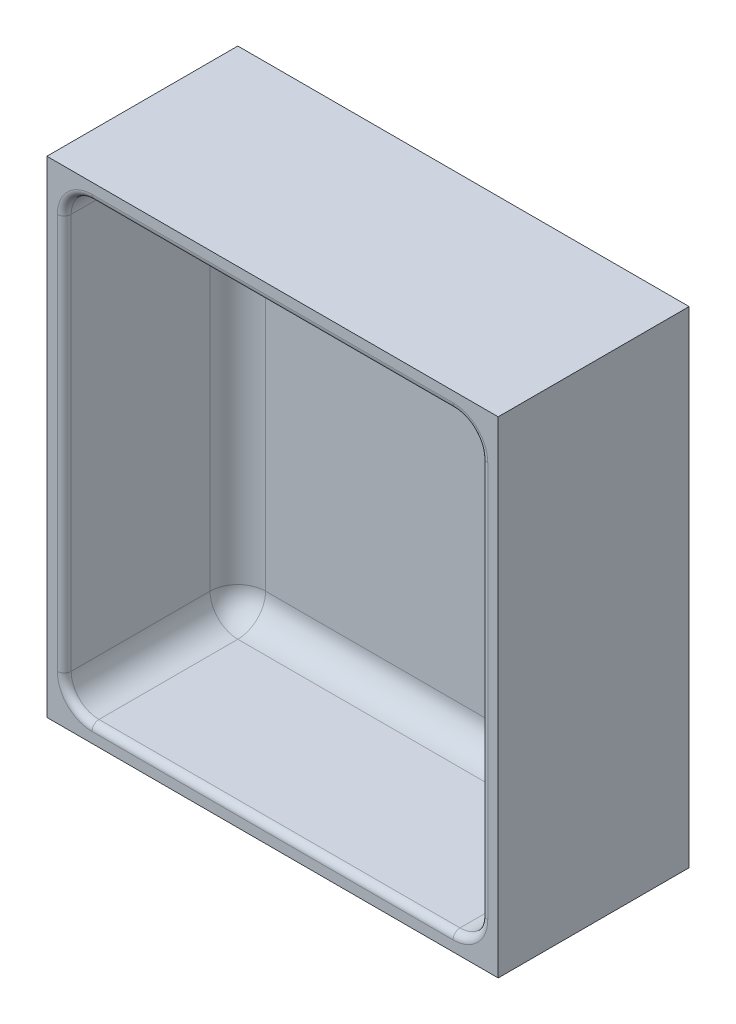
ISO-10303-21;
HEADER;
FILE_DESCRIPTION(('STEP AP214'),'2;1');
FILE_NAME('part.step','',(''),(''),'','','');
FILE_SCHEMA(('AUTOMOTIVE_DESIGN { 1 0 10303 214 1 1 1 1 }'));
ENDSEC;
DATA;
#1=APPLICATION_CONTEXT('core data for automotive mechanical design processes');
#2=APPLICATION_PROTOCOL_DEFINITION('international standard','automotive_design',2000,#1);
#3=PRODUCT_CONTEXT('',#1,'mechanical');
#4=PRODUCT('Part','Part','',(#3));
#5=PRODUCT_RELATED_PRODUCT_CATEGORY('part','',(#4));
#6=PRODUCT_DEFINITION_FORMATION('','',#4);
#7=PRODUCT_DEFINITION_CONTEXT('part definition',#1,'design');
#8=PRODUCT_DEFINITION('design','',#6,#7);
#9=PRODUCT_DEFINITION_SHAPE('','',#8);
#10=(LENGTH_UNIT() NAMED_UNIT(*) SI_UNIT(.MILLI.,.METRE.));
#11=(NAMED_UNIT(*) PLANE_ANGLE_UNIT() SI_UNIT($,.RADIAN.));
#12=(NAMED_UNIT(*) SI_UNIT($,.STERADIAN.) SOLID_ANGLE_UNIT());
#13=UNCERTAINTY_MEASURE_WITH_UNIT(LENGTH_MEASURE(1.E-05),#10,'distance_accuracy_value','');
#14=(GEOMETRIC_REPRESENTATION_CONTEXT(3) GLOBAL_UNCERTAINTY_ASSIGNED_CONTEXT((#13)) GLOBAL_UNIT_ASSIGNED_CONTEXT((#10,
#11,#12)) REPRESENTATION_CONTEXT('',''));
#15=CARTESIAN_POINT('',(0.,0.,0.));
#16=DIRECTION('',(0.,0.,1.));
#17=DIRECTION('',(1.,0.,0.));
#18=AXIS2_PLACEMENT_3D('',#15,#16,#17);
#19=CARTESIAN_POINT('',(0.,0.,5.));
#20=DIRECTION('',(0.,0.,-1.));
#21=DIRECTION('',(-1.,0.,0.));
#22=AXIS2_PLACEMENT_3D('',#19,#20,#21);
#23=PLANE('',#22);
#24=DIRECTION('',(-1.,0.,0.));
#25=VECTOR('',#24,1.);
#26=CARTESIAN_POINT('',(0.,13.,5.));
#27=LINE('',#26,#25);
#28=CARTESIAN_POINT('',(-117.,13.,5.));
#29=VERTEX_POINT('',#28);
#30=CARTESIAN_POINT('',(-13.,13.,5.));
#31=VERTEX_POINT('',#30);
#32=EDGE_CURVE('E221',#29,#31,#27,.F.);
#33=ORIENTED_EDGE('',*,*,#32,.T.);
#34=DIRECTION('',(0.,1.,0.));
#35=VECTOR('',#34,1.);
#36=CARTESIAN_POINT('',(-13.,0.,5.));
#37=LINE('',#36,#35);
#38=CARTESIAN_POINT('',(-13.,127.,5.));
#39=VERTEX_POINT('',#38);
#40=EDGE_CURVE('E227',#31,#39,#37,.T.);
#41=ORIENTED_EDGE('',*,*,#40,.T.);
#42=DIRECTION('',(1.,0.,0.));
#43=VECTOR('',#42,1.);
#44=CARTESIAN_POINT('',(0.,127.,5.));
#45=LINE('',#44,#43);
#46=CARTESIAN_POINT('',(-117.,127.,5.));
#47=VERTEX_POINT('',#46);
#48=EDGE_CURVE('E225',#39,#47,#45,.F.);
#49=ORIENTED_EDGE('',*,*,#48,.T.);
#50=DIRECTION('',(0.,1.,0.));
#51=VECTOR('',#50,1.);
#52=CARTESIAN_POINT('',(-117.,0.,5.));
#53=LINE('',#52,#51);
#54=EDGE_CURVE('E223',#47,#29,#53,.F.);
#55=ORIENTED_EDGE('',*,*,#54,.T.);
#56=EDGE_LOOP('',(#33,#41,#49,#55));
#57=FACE_BOUND('',#56,.T.);
#58=ADVANCED_FACE('F39',(#57),#23,.F.);
#59=CARTESIAN_POINT('',(-5.,5.,55.));
#60=DIRECTION('',(-1.,0.,0.));
#61=DIRECTION('',(0.,0.,1.));
#62=AXIS2_PLACEMENT_3D('',#59,#60,#61);
#63=PLANE('',#62);
#64=DIRECTION('',(0.,0.,-1.));
#65=VECTOR('',#64,1.);
#66=CARTESIAN_POINT('',(-5.,13.,55.));
#67=LINE('',#66,#65);
#68=CARTESIAN_POINT('',(-5.,13.,13.));
#69=VERTEX_POINT('',#68);
#70=CARTESIAN_POINT('',(-5.,13.,53.));
#71=VERTEX_POINT('',#70);
#72=EDGE_CURVE('E192',#69,#71,#67,.F.);
#73=ORIENTED_EDGE('',*,*,#72,.T.);
#74=DIRECTION('',(0.,1.,0.));
#75=VECTOR('',#74,1.);
#76=CARTESIAN_POINT('',(-5.,127.,53.));
#77=LINE('',#76,#75);
#78=CARTESIAN_POINT('',(-5.,127.,53.));
#79=VERTEX_POINT('',#78);
#80=EDGE_CURVE('E293',#71,#79,#77,.T.);
#81=ORIENTED_EDGE('',*,*,#80,.T.);
#82=DIRECTION('',(0.,0.,-1.));
#83=VECTOR('',#82,1.);
#84=CARTESIAN_POINT('',(-5.,127.,5.));
#85=LINE('',#84,#83);
#86=CARTESIAN_POINT('',(-5.,127.,13.));
#87=VERTEX_POINT('',#86);
#88=EDGE_CURVE('E199',#79,#87,#85,.T.);
#89=ORIENTED_EDGE('',*,*,#88,.T.);
#90=DIRECTION('',(0.,1.,0.));
#91=VECTOR('',#90,1.);
#92=CARTESIAN_POINT('',(-5.,5.,13.));
#93=LINE('',#92,#91);
#94=EDGE_CURVE('E190',#87,#69,#93,.F.);
#95=ORIENTED_EDGE('',*,*,#94,.T.);
#96=EDGE_LOOP('',(#73,#81,#89,#95));
#97=FACE_BOUND('',#96,.T.);
#98=ADVANCED_FACE('F350',(#97),#63,.T.);
#99=CARTESIAN_POINT('',(-125.,135.,55.));
#100=DIRECTION('',(0.,-1.,0.));
#101=DIRECTION('',(0.,0.,-1.));
#102=AXIS2_PLACEMENT_3D('',#99,#100,#101);
#103=PLANE('',#102);
#104=DIRECTION('',(0.,0.,-1.));
#105=VECTOR('',#104,1.);
#106=CARTESIAN_POINT('',(-13.,135.,55.));
#107=LINE('',#106,#105);
#108=CARTESIAN_POINT('',(-13.,135.,13.));
#109=VERTEX_POINT('',#108);
#110=CARTESIAN_POINT('',(-13.,135.,53.));
#111=VERTEX_POINT('',#110);
#112=EDGE_CURVE('E205',#109,#111,#107,.F.);
#113=ORIENTED_EDGE('',*,*,#112,.T.);
#114=DIRECTION('',(-1.,0.,0.));
#115=VECTOR('',#114,1.);
#116=CARTESIAN_POINT('',(-117.,135.,53.));
#117=LINE('',#116,#115);
#118=CARTESIAN_POINT('',(-117.,135.,53.));
#119=VERTEX_POINT('',#118);
#120=EDGE_CURVE('E289',#111,#119,#117,.T.);
#121=ORIENTED_EDGE('',*,*,#120,.T.);
#122=DIRECTION('',(0.,0.,-1.));
#123=VECTOR('',#122,1.);
#124=CARTESIAN_POINT('',(-117.,135.,5.));
#125=LINE('',#124,#123);
#126=CARTESIAN_POINT('',(-117.,135.,13.));
#127=VERTEX_POINT('',#126);
#128=EDGE_CURVE('E203',#119,#127,#125,.T.);
#129=ORIENTED_EDGE('',*,*,#128,.T.);
#130=DIRECTION('',(1.,0.,0.));
#131=VECTOR('',#130,1.);
#132=CARTESIAN_POINT('',(-125.,135.,13.));
#133=LINE('',#132,#131);
#134=EDGE_CURVE('E201',#127,#109,#133,.T.);
#135=ORIENTED_EDGE('',*,*,#134,.T.);
#136=EDGE_LOOP('',(#113,#121,#129,#135));
#137=FACE_BOUND('',#136,.T.);
#138=ADVANCED_FACE('F333',(#137),#103,.T.);
#139=CARTESIAN_POINT('',(-125.,5.,55.));
#140=DIRECTION('',(1.,0.,0.));
#141=DIRECTION('',(0.,0.,-1.));
#142=AXIS2_PLACEMENT_3D('',#139,#140,#141);
#143=PLANE('',#142);
#144=DIRECTION('',(0.,0.,-1.));
#145=VECTOR('',#144,1.);
#146=CARTESIAN_POINT('',(-125.,127.,55.));
#147=LINE('',#146,#145);
#148=CARTESIAN_POINT('',(-125.,127.,13.));
#149=VERTEX_POINT('',#148);
#150=CARTESIAN_POINT('',(-125.,127.,53.));
#151=VERTEX_POINT('',#150);
#152=EDGE_CURVE('E212',#149,#151,#147,.F.);
#153=ORIENTED_EDGE('',*,*,#152,.T.);
#154=DIRECTION('',(0.,-1.,0.));
#155=VECTOR('',#154,1.);
#156=CARTESIAN_POINT('',(-125.,13.,53.));
#157=LINE('',#156,#155);
#158=CARTESIAN_POINT('',(-125.,13.,53.));
#159=VERTEX_POINT('',#158);
#160=EDGE_CURVE('E285',#151,#159,#157,.T.);
#161=ORIENTED_EDGE('',*,*,#160,.T.);
#162=DIRECTION('',(0.,0.,-1.));
#163=VECTOR('',#162,1.);
#164=CARTESIAN_POINT('',(-125.,13.,5.));
#165=LINE('',#164,#163);
#166=CARTESIAN_POINT('',(-125.,13.,13.));
#167=VERTEX_POINT('',#166);
#168=EDGE_CURVE('E210',#159,#167,#165,.T.);
#169=ORIENTED_EDGE('',*,*,#168,.T.);
#170=DIRECTION('',(0.,1.,0.));
#171=VECTOR('',#170,1.);
#172=CARTESIAN_POINT('',(-125.,5.,13.));
#173=LINE('',#172,#171);
#174=EDGE_CURVE('E208',#167,#149,#173,.T.);
#175=ORIENTED_EDGE('',*,*,#174,.T.);
#176=EDGE_LOOP('',(#153,#161,#169,#175));
#177=FACE_BOUND('',#176,.T.);
#178=ADVANCED_FACE('F378',(#177),#143,.T.);
#179=CARTESIAN_POINT('',(-5.,5.,55.));
#180=DIRECTION('',(0.,1.,0.));
#181=DIRECTION('',(0.,0.,1.));
#182=AXIS2_PLACEMENT_3D('',#179,#180,#181);
#183=PLANE('',#182);
#184=DIRECTION('',(0.,0.,-1.));
#185=VECTOR('',#184,1.);
#186=CARTESIAN_POINT('',(-117.,5.,55.));
#187=LINE('',#186,#185);
#188=CARTESIAN_POINT('',(-117.,5.,13.));
#189=VERTEX_POINT('',#188);
#190=CARTESIAN_POINT('',(-117.,5.,53.));
#191=VERTEX_POINT('',#190);
#192=EDGE_CURVE('E219',#189,#191,#187,.F.);
#193=ORIENTED_EDGE('',*,*,#192,.T.);
#194=DIRECTION('',(1.,0.,0.));
#195=VECTOR('',#194,1.);
#196=CARTESIAN_POINT('',(-13.,5.,53.));
#197=LINE('',#196,#195);
#198=CARTESIAN_POINT('',(-13.,5.,53.));
#199=VERTEX_POINT('',#198);
#200=EDGE_CURVE('E11',#191,#199,#197,.T.);
#201=ORIENTED_EDGE('',*,*,#200,.T.);
#202=DIRECTION('',(0.,0.,-1.));
#203=VECTOR('',#202,1.);
#204=CARTESIAN_POINT('',(-13.,5.,5.));
#205=LINE('',#204,#203);
#206=CARTESIAN_POINT('',(-13.,5.,13.));
#207=VERTEX_POINT('',#206);
#208=EDGE_CURVE('E217',#199,#207,#205,.T.);
#209=ORIENTED_EDGE('',*,*,#208,.T.);
#210=DIRECTION('',(-1.,0.,0.));
#211=VECTOR('',#210,1.);
#212=CARTESIAN_POINT('',(-5.,5.,13.));
#213=LINE('',#212,#211);
#214=EDGE_CURVE('E215',#207,#189,#213,.T.);
#215=ORIENTED_EDGE('',*,*,#214,.T.);
#216=EDGE_LOOP('',(#193,#201,#209,#215));
#217=FACE_BOUND('',#216,.T.);
#218=ADVANCED_FACE('F362',(#217),#183,.T.);
#219=CARTESIAN_POINT('',(0.,0.,55.));
#220=DIRECTION('',(0.,0.,-1.));
#221=DIRECTION('',(-1.,0.,0.));
#222=AXIS2_PLACEMENT_3D('',#219,#220,#221);
#223=PLANE('',#222);
#224=DIRECTION('',(1.,0.,0.));
#225=VECTOR('',#224,1.);
#226=CARTESIAN_POINT('',(-117.,3.,55.));
#227=LINE('',#226,#225);
#228=CARTESIAN_POINT('',(-13.,3.,55.));
#229=VERTEX_POINT('',#228);
#230=CARTESIAN_POINT('',(-117.,3.,55.));
#231=VERTEX_POINT('',#230);
#232=EDGE_CURVE('E230',#229,#231,#227,.F.);
#233=ORIENTED_EDGE('',*,*,#232,.T.);
#234=CARTESIAN_POINT('',(-117.,13.,55.));
#235=DIRECTION('',(0.,0.,-1.));
#236=DIRECTION('',(-1.,0.,0.));
#237=AXIS2_PLACEMENT_3D('',#234,#235,#236);
#238=CIRCLE('',#237,10.);
#239=CARTESIAN_POINT('',(-127.,13.,55.));
#240=VERTEX_POINT('',#239);
#241=EDGE_CURVE('E279',#231,#240,#238,.T.);
#242=ORIENTED_EDGE('',*,*,#241,.T.);
#243=DIRECTION('',(0.,-1.,0.));
#244=VECTOR('',#243,1.);
#245=CARTESIAN_POINT('',(-127.,127.,55.));
#246=LINE('',#245,#244);
#247=CARTESIAN_POINT('',(-127.,127.,55.));
#248=VERTEX_POINT('',#247);
#249=EDGE_CURVE('E277',#240,#248,#246,.F.);
#250=ORIENTED_EDGE('',*,*,#249,.T.);
#251=CARTESIAN_POINT('',(-117.,127.,55.));
#252=DIRECTION('',(0.,0.,-1.));
#253=DIRECTION('',(-1.,0.,0.));
#254=AXIS2_PLACEMENT_3D('',#251,#252,#253);
#255=CIRCLE('',#254,10.);
#256=CARTESIAN_POINT('',(-117.,137.,55.));
#257=VERTEX_POINT('',#256);
#258=EDGE_CURVE('E275',#248,#257,#255,.T.);
#259=ORIENTED_EDGE('',*,*,#258,.T.);
#260=DIRECTION('',(-1.,0.,0.));
#261=VECTOR('',#260,1.);
#262=CARTESIAN_POINT('',(-13.,137.,55.));
#263=LINE('',#262,#261);
#264=CARTESIAN_POINT('',(-13.,137.,55.));
#265=VERTEX_POINT('',#264);
#266=EDGE_CURVE('E273',#257,#265,#263,.F.);
#267=ORIENTED_EDGE('',*,*,#266,.T.);
#268=CARTESIAN_POINT('',(-13.,127.,55.));
#269=DIRECTION('',(0.,0.,-1.));
#270=DIRECTION('',(-1.,0.,0.));
#271=AXIS2_PLACEMENT_3D('',#268,#269,#270);
#272=CIRCLE('',#271,10.);
#273=CARTESIAN_POINT('',(-3.,127.,55.));
#274=VERTEX_POINT('',#273);
#275=EDGE_CURVE('E271',#265,#274,#272,.T.);
#276=ORIENTED_EDGE('',*,*,#275,.T.);
#277=DIRECTION('',(0.,1.,0.));
#278=VECTOR('',#277,1.);
#279=CARTESIAN_POINT('',(-3.,13.,55.));
#280=LINE('',#279,#278);
#281=CARTESIAN_POINT('',(-3.,13.,55.));
#282=VERTEX_POINT('',#281);
#283=EDGE_CURVE('E269',#274,#282,#280,.F.);
#284=ORIENTED_EDGE('',*,*,#283,.T.);
#285=CARTESIAN_POINT('',(-13.,13.,55.));
#286=DIRECTION('',(0.,0.,-1.));
#287=DIRECTION('',(-1.,0.,0.));
#288=AXIS2_PLACEMENT_3D('',#285,#286,#287);
#289=CIRCLE('',#288,10.);
#290=EDGE_CURVE('E267',#282,#229,#289,.T.);
#291=ORIENTED_EDGE('',*,*,#290,.T.);
#292=EDGE_LOOP('',(#233,#242,#250,#259,#267,#276,#284,#291));
#293=FACE_BOUND('',#292,.T.);
#294=DIRECTION('',(1.,0.,0.));
#295=VECTOR('',#294,1.);
#296=CARTESIAN_POINT('',(0.,0.,55.));
#297=LINE('',#296,#295);
#298=CARTESIAN_POINT('',(-130.,0.,55.));
#299=VERTEX_POINT('',#298);
#300=CARTESIAN_POINT('',(0.,0.,55.));
#301=VERTEX_POINT('',#300);
#302=EDGE_CURVE('E176',#299,#301,#297,.T.);
#303=ORIENTED_EDGE('',*,*,#302,.T.);
#304=DIRECTION('',(0.,1.,0.));
#305=VECTOR('',#304,1.);
#306=CARTESIAN_POINT('',(0.,0.,55.));
#307=LINE('',#306,#305);
#308=CARTESIAN_POINT('',(0.,140.,55.));
#309=VERTEX_POINT('',#308);
#310=EDGE_CURVE('E165',#301,#309,#307,.T.);
#311=ORIENTED_EDGE('',*,*,#310,.T.);
#312=DIRECTION('',(-1.,0.,0.));
#313=VECTOR('',#312,1.);
#314=CARTESIAN_POINT('',(-130.,140.,55.));
#315=LINE('',#314,#313);
#316=CARTESIAN_POINT('',(-130.,140.,55.));
#317=VERTEX_POINT('',#316);
#318=EDGE_CURVE('E175',#309,#317,#315,.T.);
#319=ORIENTED_EDGE('',*,*,#318,.T.);
#320=DIRECTION('',(0.,-1.,0.));
#321=VECTOR('',#320,1.);
#322=CARTESIAN_POINT('',(-130.,0.,55.));
#323=LINE('',#322,#321);
#324=EDGE_CURVE('E181',#317,#299,#323,.T.);
#325=ORIENTED_EDGE('',*,*,#324,.T.);
#326=EDGE_LOOP('',(#303,#311,#319,#325));
#327=FACE_BOUND('',#326,.T.);
#328=ADVANCED_FACE('F179',(#293,#327),#223,.F.);
#329=CARTESIAN_POINT('',(0.,0.,55.));
#330=DIRECTION('',(0.,1.,0.));
#331=DIRECTION('',(0.,0.,1.));
#332=AXIS2_PLACEMENT_3D('',#329,#330,#331);
#333=PLANE('',#332);
#334=DIRECTION('',(1.,0.,0.));
#335=VECTOR('',#334,1.);
#336=CARTESIAN_POINT('',(0.,0.,0.));
#337=LINE('',#336,#335);
#338=CARTESIAN_POINT('',(-130.,0.,0.));
#339=VERTEX_POINT('',#338);
#340=CARTESIAN_POINT('',(0.,0.,0.));
#341=VERTEX_POINT('',#340);
#342=EDGE_CURVE('E189',#339,#341,#337,.T.);
#343=ORIENTED_EDGE('',*,*,#342,.T.);
#344=DIRECTION('',(0.,0.,-1.));
#345=VECTOR('',#344,1.);
#346=CARTESIAN_POINT('',(0.,0.,55.));
#347=LINE('',#346,#345);
#348=EDGE_CURVE('E169',#301,#341,#347,.T.);
#349=ORIENTED_EDGE('',*,*,#348,.F.);
#350=ORIENTED_EDGE('',*,*,#302,.F.);
#351=DIRECTION('',(0.,0.,-1.));
#352=VECTOR('',#351,1.);
#353=CARTESIAN_POINT('',(-130.,0.,55.));
#354=LINE('',#353,#352);
#355=EDGE_CURVE('E671',#299,#339,#354,.T.);
#356=ORIENTED_EDGE('',*,*,#355,.T.);
#357=EDGE_LOOP('',(#343,#349,#350,#356));
#358=FACE_BOUND('',#357,.T.);
#359=ADVANCED_FACE('F187',(#358),#333,.F.);
#360=CARTESIAN_POINT('',(0.,0.,55.));
#361=DIRECTION('',(-1.,0.,0.));
#362=DIRECTION('',(0.,0.,1.));
#363=AXIS2_PLACEMENT_3D('',#360,#361,#362);
#364=PLANE('',#363);
#365=DIRECTION('',(0.,1.,0.));
#366=VECTOR('',#365,1.);
#367=CARTESIAN_POINT('',(0.,0.,0.));
#368=LINE('',#367,#366);
#369=CARTESIAN_POINT('',(0.,140.,0.));
#370=VERTEX_POINT('',#369);
#371=EDGE_CURVE('E669',#341,#370,#368,.T.);
#372=ORIENTED_EDGE('',*,*,#371,.T.);
#373=DIRECTION('',(0.,0.,-1.));
#374=VECTOR('',#373,1.);
#375=CARTESIAN_POINT('',(0.,140.,55.));
#376=LINE('',#375,#374);
#377=EDGE_CURVE('E172',#309,#370,#376,.T.);
#378=ORIENTED_EDGE('',*,*,#377,.F.);
#379=ORIENTED_EDGE('',*,*,#310,.F.);
#380=ORIENTED_EDGE('',*,*,#348,.T.);
#381=EDGE_LOOP('',(#372,#378,#379,#380));
#382=FACE_BOUND('',#381,.T.);
#383=ADVANCED_FACE('F167',(#382),#364,.F.);
#384=CARTESIAN_POINT('',(-130.,140.,55.));
#385=DIRECTION('',(0.,-1.,0.));
#386=DIRECTION('',(0.,0.,-1.));
#387=AXIS2_PLACEMENT_3D('',#384,#385,#386);
#388=PLANE('',#387);
#389=DIRECTION('',(-1.,0.,0.));
#390=VECTOR('',#389,1.);
#391=CARTESIAN_POINT('',(-130.,140.,0.));
#392=LINE('',#391,#390);
#393=CARTESIAN_POINT('',(-130.,140.,0.));
#394=VERTEX_POINT('',#393);
#395=EDGE_CURVE('E666',#370,#394,#392,.T.);
#396=ORIENTED_EDGE('',*,*,#395,.T.);
#397=DIRECTION('',(0.,0.,-1.));
#398=VECTOR('',#397,1.);
#399=CARTESIAN_POINT('',(-130.,140.,55.));
#400=LINE('',#399,#398);
#401=EDGE_CURVE('E194',#317,#394,#400,.T.);
#402=ORIENTED_EDGE('',*,*,#401,.F.);
#403=ORIENTED_EDGE('',*,*,#318,.F.);
#404=ORIENTED_EDGE('',*,*,#377,.T.);
#405=EDGE_LOOP('',(#396,#402,#403,#404));
#406=FACE_BOUND('',#405,.T.);
#407=ADVANCED_FACE('F572',(#406),#388,.F.);
#408=CARTESIAN_POINT('',(-130.,0.,55.));
#409=DIRECTION('',(1.,0.,0.));
#410=DIRECTION('',(0.,0.,-1.));
#411=AXIS2_PLACEMENT_3D('',#408,#409,#410);
#412=PLANE('',#411);
#413=DIRECTION('',(0.,-1.,0.));
#414=VECTOR('',#413,1.);
#415=CARTESIAN_POINT('',(-130.,0.,0.));
#416=LINE('',#415,#414);
#417=EDGE_CURVE('E185',#394,#339,#416,.T.);
#418=ORIENTED_EDGE('',*,*,#417,.T.);
#419=ORIENTED_EDGE('',*,*,#355,.F.);
#420=ORIENTED_EDGE('',*,*,#324,.F.);
#421=ORIENTED_EDGE('',*,*,#401,.T.);
#422=EDGE_LOOP('',(#418,#419,#420,#421));
#423=FACE_BOUND('',#422,.T.);
#424=ADVANCED_FACE('F427',(#423),#412,.F.);
#425=CARTESIAN_POINT('',(0.,0.,0.));
#426=DIRECTION('',(0.,0.,-1.));
#427=DIRECTION('',(-1.,0.,0.));
#428=AXIS2_PLACEMENT_3D('',#425,#426,#427);
#429=PLANE('',#428);
#430=ORIENTED_EDGE('',*,*,#342,.F.);
#431=ORIENTED_EDGE('',*,*,#417,.F.);
#432=ORIENTED_EDGE('',*,*,#395,.F.);
#433=ORIENTED_EDGE('',*,*,#371,.F.);
#434=EDGE_LOOP('',(#430,#431,#432,#433));
#435=FACE_BOUND('',#434,.T.);
#436=ADVANCED_FACE('F425',(#435),#429,.T.);
#437=CARTESIAN_POINT('',(-117.,13.,55.));
#438=DIRECTION('',(0.,0.,1.));
#439=DIRECTION('',(1.,0.,0.));
#440=AXIS2_PLACEMENT_3D('',#437,#438,#439);
#441=CYLINDRICAL_SURFACE('',#440,8.);
#442=ORIENTED_EDGE('',*,*,#168,.F.);
#443=CARTESIAN_POINT('',(-117.,13.,53.));
#444=DIRECTION('',(0.,0.,-1.));
#445=DIRECTION('',(-1.,0.,0.));
#446=AXIS2_PLACEMENT_3D('',#443,#444,#445);
#447=CIRCLE('',#446,8.);
#448=EDGE_CURVE('E282',#159,#191,#447,.F.);
#449=ORIENTED_EDGE('',*,*,#448,.T.);
#450=ORIENTED_EDGE('',*,*,#192,.F.);
#451=CARTESIAN_POINT('',(-117.,13.,13.));
#452=DIRECTION('',(0.,0.,1.));
#453=DIRECTION('',(1.,0.,0.));
#454=AXIS2_PLACEMENT_3D('',#451,#452,#453);
#455=CIRCLE('',#454,8.);
#456=EDGE_CURVE('E263',#167,#189,#455,.T.);
#457=ORIENTED_EDGE('',*,*,#456,.F.);
#458=EDGE_LOOP('',(#442,#449,#450,#457));
#459=FACE_BOUND('',#458,.T.);
#460=ADVANCED_FACE('F366',(#459),#441,.F.);
#461=CARTESIAN_POINT('',(-117.,13.,13.));
#462=DIRECTION('',(0.,-1.,0.));
#463=DIRECTION('',(0.,0.,-1.));
#464=AXIS2_PLACEMENT_3D('',#461,#462,#463);
#465=SPHERICAL_SURFACE('',#464,8.);
#466=CARTESIAN_POINT('',(-117.,13.,13.));
#467=DIRECTION('',(0.,1.,0.));
#468=DIRECTION('',(0.,0.,1.));
#469=AXIS2_PLACEMENT_3D('',#466,#467,#468);
#470=CIRCLE('',#469,8.);
#471=EDGE_CURVE('E257',#167,#29,#470,.F.);
#472=ORIENTED_EDGE('',*,*,#471,.F.);
#473=ORIENTED_EDGE('',*,*,#456,.T.);
#474=CARTESIAN_POINT('',(-117.,13.,13.));
#475=DIRECTION('',(1.,0.,0.));
#476=DIRECTION('',(0.,0.,-1.));
#477=AXIS2_PLACEMENT_3D('',#474,#475,#476);
#478=CIRCLE('',#477,8.);
#479=EDGE_CURVE('E260',#29,#189,#478,.F.);
#480=ORIENTED_EDGE('',*,*,#479,.F.);
#481=EDGE_LOOP('',(#472,#473,#480));
#482=FACE_BOUND('',#481,.T.);
#483=ADVANCED_FACE('F370',(#482),#465,.F.);
#484=CARTESIAN_POINT('',(-13.,13.,55.));
#485=DIRECTION('',(0.,0.,1.));
#486=DIRECTION('',(1.,0.,0.));
#487=AXIS2_PLACEMENT_3D('',#484,#485,#486);
#488=CYLINDRICAL_SURFACE('',#487,8.);
#489=ORIENTED_EDGE('',*,*,#208,.F.);
#490=CARTESIAN_POINT('',(-13.,13.,53.));
#491=DIRECTION('',(0.,0.,-1.));
#492=DIRECTION('',(-1.,0.,0.));
#493=AXIS2_PLACEMENT_3D('',#490,#491,#492);
#494=CIRCLE('',#493,8.);
#495=EDGE_CURVE('E48',#199,#71,#494,.F.);
#496=ORIENTED_EDGE('',*,*,#495,.T.);
#497=ORIENTED_EDGE('',*,*,#72,.F.);
#498=CARTESIAN_POINT('',(-13.,13.,13.));
#499=DIRECTION('',(0.,0.,1.));
#500=DIRECTION('',(1.,0.,0.));
#501=AXIS2_PLACEMENT_3D('',#498,#499,#500);
#502=CIRCLE('',#501,8.);
#503=EDGE_CURVE('E254',#207,#69,#502,.T.);
#504=ORIENTED_EDGE('',*,*,#503,.F.);
#505=EDGE_LOOP('',(#489,#496,#497,#504));
#506=FACE_BOUND('',#505,.T.);
#507=ADVANCED_FACE('F352',(#506),#488,.F.);
#508=CARTESIAN_POINT('',(-5.,13.,13.));
#509=DIRECTION('',(-1.,0.,0.));
#510=DIRECTION('',(0.,0.,1.));
#511=AXIS2_PLACEMENT_3D('',#508,#509,#510);
#512=CYLINDRICAL_SURFACE('',#511,8.);
#513=ORIENTED_EDGE('',*,*,#479,.T.);
#514=ORIENTED_EDGE('',*,*,#214,.F.);
#515=CARTESIAN_POINT('',(-13.,13.,13.));
#516=DIRECTION('',(-1.,0.,0.));
#517=DIRECTION('',(0.,0.,1.));
#518=AXIS2_PLACEMENT_3D('',#515,#516,#517);
#519=CIRCLE('',#518,8.);
#520=EDGE_CURVE('E251',#31,#207,#519,.T.);
#521=ORIENTED_EDGE('',*,*,#520,.F.);
#522=ORIENTED_EDGE('',*,*,#32,.F.);
#523=EDGE_LOOP('',(#513,#514,#521,#522));
#524=FACE_BOUND('',#523,.T.);
#525=ADVANCED_FACE('F359',(#524),#512,.F.);
#526=CARTESIAN_POINT('',(-117.,5.,13.));
#527=DIRECTION('',(0.,1.,0.));
#528=DIRECTION('',(0.,0.,1.));
#529=AXIS2_PLACEMENT_3D('',#526,#527,#528);
#530=CYLINDRICAL_SURFACE('',#529,8.);
#531=ORIENTED_EDGE('',*,*,#471,.T.);
#532=ORIENTED_EDGE('',*,*,#54,.F.);
#533=CARTESIAN_POINT('',(-117.,127.,13.));
#534=DIRECTION('',(0.,-1.,0.));
#535=DIRECTION('',(0.,0.,-1.));
#536=AXIS2_PLACEMENT_3D('',#533,#534,#535);
#537=CIRCLE('',#536,8.);
#538=EDGE_CURVE('E248',#149,#47,#537,.T.);
#539=ORIENTED_EDGE('',*,*,#538,.F.);
#540=ORIENTED_EDGE('',*,*,#174,.F.);
#541=EDGE_LOOP('',(#531,#532,#539,#540));
#542=FACE_BOUND('',#541,.T.);
#543=ADVANCED_FACE('F375',(#542),#530,.F.);
#544=CARTESIAN_POINT('',(-117.,127.,55.));
#545=DIRECTION('',(0.,0.,1.));
#546=DIRECTION('',(1.,0.,0.));
#547=AXIS2_PLACEMENT_3D('',#544,#545,#546);
#548=CYLINDRICAL_SURFACE('',#547,8.);
#549=ORIENTED_EDGE('',*,*,#128,.F.);
#550=CARTESIAN_POINT('',(-117.,127.,53.));
#551=DIRECTION('',(0.,0.,-1.));
#552=DIRECTION('',(-1.,0.,0.));
#553=AXIS2_PLACEMENT_3D('',#550,#551,#552);
#554=CIRCLE('',#553,8.);
#555=EDGE_CURVE('E287',#119,#151,#554,.F.);
#556=ORIENTED_EDGE('',*,*,#555,.T.);
#557=ORIENTED_EDGE('',*,*,#152,.F.);
#558=CARTESIAN_POINT('',(-117.,127.,13.));
#559=DIRECTION('',(0.,0.,1.));
#560=DIRECTION('',(1.,0.,0.));
#561=AXIS2_PLACEMENT_3D('',#558,#559,#560);
#562=CIRCLE('',#561,8.);
#563=EDGE_CURVE('E245',#127,#149,#562,.T.);
#564=ORIENTED_EDGE('',*,*,#563,.F.);
#565=EDGE_LOOP('',(#549,#556,#557,#564));
#566=FACE_BOUND('',#565,.T.);
#567=ADVANCED_FACE('F381',(#566),#548,.F.);
#568=CARTESIAN_POINT('',(-13.,13.,13.));
#569=DIRECTION('',(0.,-1.,0.));
#570=DIRECTION('',(0.,0.,-1.));
#571=AXIS2_PLACEMENT_3D('',#568,#569,#570);
#572=SPHERICAL_SURFACE('',#571,8.);
#573=ORIENTED_EDGE('',*,*,#520,.T.);
#574=ORIENTED_EDGE('',*,*,#503,.T.);
#575=CARTESIAN_POINT('',(-13.,13.,13.));
#576=DIRECTION('',(0.,1.,0.));
#577=DIRECTION('',(0.,0.,1.));
#578=AXIS2_PLACEMENT_3D('',#575,#576,#577);
#579=CIRCLE('',#578,8.);
#580=EDGE_CURVE('E242',#31,#69,#579,.F.);
#581=ORIENTED_EDGE('',*,*,#580,.F.);
#582=EDGE_LOOP('',(#573,#574,#581));
#583=FACE_BOUND('',#582,.T.);
#584=ADVANCED_FACE('F354',(#583),#572,.F.);
#585=CARTESIAN_POINT('',(-117.,127.,13.));
#586=DIRECTION('',(-1.,0.,0.));
#587=DIRECTION('',(0.,0.,1.));
#588=AXIS2_PLACEMENT_3D('',#585,#586,#587);
#589=SPHERICAL_SURFACE('',#588,8.);
#590=ORIENTED_EDGE('',*,*,#563,.T.);
#591=ORIENTED_EDGE('',*,*,#538,.T.);
#592=CARTESIAN_POINT('',(-117.,127.,13.));
#593=DIRECTION('',(1.,0.,0.));
#594=DIRECTION('',(0.,0.,-1.));
#595=AXIS2_PLACEMENT_3D('',#592,#593,#594);
#596=CIRCLE('',#595,8.);
#597=EDGE_CURVE('E239',#127,#47,#596,.F.);
#598=ORIENTED_EDGE('',*,*,#597,.F.);
#599=EDGE_LOOP('',(#590,#591,#598));
#600=FACE_BOUND('',#599,.T.);
#601=ADVANCED_FACE('F437',(#600),#589,.F.);
#602=CARTESIAN_POINT('',(-13.,0.,13.));
#603=DIRECTION('',(0.,1.,0.));
#604=DIRECTION('',(0.,0.,1.));
#605=AXIS2_PLACEMENT_3D('',#602,#603,#604);
#606=CYLINDRICAL_SURFACE('',#605,8.);
#607=ORIENTED_EDGE('',*,*,#580,.T.);
#608=ORIENTED_EDGE('',*,*,#94,.F.);
#609=CARTESIAN_POINT('',(-13.,127.,13.));
#610=DIRECTION('',(0.,-1.,0.));
#611=DIRECTION('',(0.,0.,-1.));
#612=AXIS2_PLACEMENT_3D('',#609,#610,#611);
#613=CIRCLE('',#612,8.);
#614=EDGE_CURVE('E236',#39,#87,#613,.T.);
#615=ORIENTED_EDGE('',*,*,#614,.F.);
#616=ORIENTED_EDGE('',*,*,#40,.F.);
#617=EDGE_LOOP('',(#607,#608,#615,#616));
#618=FACE_BOUND('',#617,.T.);
#619=ADVANCED_FACE('F347',(#618),#606,.F.);
#620=CARTESIAN_POINT('',(-125.,127.,13.));
#621=DIRECTION('',(1.,0.,0.));
#622=DIRECTION('',(0.,0.,-1.));
#623=AXIS2_PLACEMENT_3D('',#620,#621,#622);
#624=CYLINDRICAL_SURFACE('',#623,8.);
#625=ORIENTED_EDGE('',*,*,#597,.T.);
#626=ORIENTED_EDGE('',*,*,#48,.F.);
#627=CARTESIAN_POINT('',(-13.,127.,13.));
#628=DIRECTION('',(-1.,0.,0.));
#629=DIRECTION('',(0.,0.,1.));
#630=AXIS2_PLACEMENT_3D('',#627,#628,#629);
#631=CIRCLE('',#630,8.);
#632=EDGE_CURVE('E234',#109,#39,#631,.T.);
#633=ORIENTED_EDGE('',*,*,#632,.F.);
#634=ORIENTED_EDGE('',*,*,#134,.F.);
#635=EDGE_LOOP('',(#625,#626,#633,#634));
#636=FACE_BOUND('',#635,.T.);
#637=ADVANCED_FACE('F340',(#636),#624,.F.);
#638=CARTESIAN_POINT('',(-13.,127.,13.));
#639=DIRECTION('',(0.,0.,-1.));
#640=DIRECTION('',(-1.,0.,0.));
#641=AXIS2_PLACEMENT_3D('',#638,#639,#640);
#642=SPHERICAL_SURFACE('',#641,8.);
#643=ORIENTED_EDGE('',*,*,#632,.T.);
#644=ORIENTED_EDGE('',*,*,#614,.T.);
#645=CARTESIAN_POINT('',(-13.,127.,13.));
#646=DIRECTION('',(0.,0.,1.));
#647=DIRECTION('',(0.,-1.,0.));
#648=AXIS2_PLACEMENT_3D('',#645,#646,#647);
#649=CIRCLE('',#648,8.);
#650=EDGE_CURVE('E231',#109,#87,#649,.F.);
#651=ORIENTED_EDGE('',*,*,#650,.F.);
#652=EDGE_LOOP('',(#643,#644,#651));
#653=FACE_BOUND('',#652,.T.);
#654=ADVANCED_FACE('F343',(#653),#642,.F.);
#655=CARTESIAN_POINT('',(-13.,127.,55.));
#656=DIRECTION('',(0.,0.,1.));
#657=DIRECTION('',(1.,0.,0.));
#658=AXIS2_PLACEMENT_3D('',#655,#656,#657);
#659=CYLINDRICAL_SURFACE('',#658,8.);
#660=ORIENTED_EDGE('',*,*,#88,.F.);
#661=CARTESIAN_POINT('',(-13.,127.,53.));
#662=DIRECTION('',(0.,0.,-1.));
#663=DIRECTION('',(-1.,0.,0.));
#664=AXIS2_PLACEMENT_3D('',#661,#662,#663);
#665=CIRCLE('',#664,8.);
#666=EDGE_CURVE('E291',#79,#111,#665,.F.);
#667=ORIENTED_EDGE('',*,*,#666,.T.);
#668=ORIENTED_EDGE('',*,*,#112,.F.);
#669=ORIENTED_EDGE('',*,*,#650,.T.);
#670=EDGE_LOOP('',(#660,#667,#668,#669));
#671=FACE_BOUND('',#670,.T.);
#672=ADVANCED_FACE('F330',(#671),#659,.F.);
#673=CARTESIAN_POINT('',(-13.,127.,53.));
#674=DIRECTION('',(0.,0.,-1.));
#675=DIRECTION('',(-1.,0.,0.));
#676=AXIS2_PLACEMENT_3D('',#673,#674,#675);
#677=TOROIDAL_SURFACE('',#676,10.,2.);
#678=CARTESIAN_POINT('',(-13.,137.,53.));
#679=DIRECTION('',(-1.,0.,0.));
#680=DIRECTION('',(0.,0.,1.));
#681=AXIS2_PLACEMENT_3D('',#678,#679,#680);
#682=CIRCLE('',#681,2.);
#683=EDGE_CURVE('E311',#111,#265,#682,.T.);
#684=ORIENTED_EDGE('',*,*,#683,.F.);
#685=ORIENTED_EDGE('',*,*,#666,.F.);
#686=CARTESIAN_POINT('',(-3.,127.,53.));
#687=DIRECTION('',(0.,-1.,0.));
#688=DIRECTION('',(0.,0.,-1.));
#689=AXIS2_PLACEMENT_3D('',#686,#687,#688);
#690=CIRCLE('',#689,2.);
#691=EDGE_CURVE('E43',#274,#79,#690,.T.);
#692=ORIENTED_EDGE('',*,*,#691,.F.);
#693=ORIENTED_EDGE('',*,*,#275,.F.);
#694=EDGE_LOOP('',(#684,#685,#692,#693));
#695=FACE_BOUND('',#694,.T.);
#696=ADVANCED_FACE('F41',(#695),#677,.T.);
#697=CARTESIAN_POINT('',(-3.,5.,53.));
#698=DIRECTION('',(0.,-1.,0.));
#699=DIRECTION('',(0.,0.,-1.));
#700=AXIS2_PLACEMENT_3D('',#697,#698,#699);
#701=CYLINDRICAL_SURFACE('',#700,2.);
#702=ORIENTED_EDGE('',*,*,#691,.T.);
#703=ORIENTED_EDGE('',*,*,#80,.F.);
#704=CARTESIAN_POINT('',(-3.,13.,53.));
#705=DIRECTION('',(0.,-1.,0.));
#706=DIRECTION('',(0.,0.,-1.));
#707=AXIS2_PLACEMENT_3D('',#704,#705,#706);
#708=CIRCLE('',#707,2.);
#709=EDGE_CURVE('E309',#282,#71,#708,.T.);
#710=ORIENTED_EDGE('',*,*,#709,.F.);
#711=ORIENTED_EDGE('',*,*,#283,.F.);
#712=EDGE_LOOP('',(#702,#703,#710,#711));
#713=FACE_BOUND('',#712,.T.);
#714=ADVANCED_FACE('F322',(#713),#701,.T.);
#715=CARTESIAN_POINT('',(-125.,137.,53.));
#716=DIRECTION('',(1.,0.,0.));
#717=DIRECTION('',(0.,0.,-1.));
#718=AXIS2_PLACEMENT_3D('',#715,#716,#717);
#719=CYLINDRICAL_SURFACE('',#718,2.);
#720=ORIENTED_EDGE('',*,*,#683,.T.);
#721=ORIENTED_EDGE('',*,*,#266,.F.);
#722=CARTESIAN_POINT('',(-117.,137.,53.));
#723=DIRECTION('',(-1.,0.,0.));
#724=DIRECTION('',(0.,0.,1.));
#725=AXIS2_PLACEMENT_3D('',#722,#723,#724);
#726=CIRCLE('',#725,2.);
#727=EDGE_CURVE('E306',#119,#257,#726,.T.);
#728=ORIENTED_EDGE('',*,*,#727,.F.);
#729=ORIENTED_EDGE('',*,*,#120,.F.);
#730=EDGE_LOOP('',(#720,#721,#728,#729));
#731=FACE_BOUND('',#730,.T.);
#732=ADVANCED_FACE('F405',(#731),#719,.T.);
#733=CARTESIAN_POINT('',(-13.,13.,53.));
#734=DIRECTION('',(0.,0.,-1.));
#735=DIRECTION('',(-1.,0.,0.));
#736=AXIS2_PLACEMENT_3D('',#733,#734,#735);
#737=TOROIDAL_SURFACE('',#736,10.,2.);
#738=ORIENTED_EDGE('',*,*,#709,.T.);
#739=ORIENTED_EDGE('',*,*,#495,.F.);
#740=CARTESIAN_POINT('',(-13.,3.,53.));
#741=DIRECTION('',(-1.,0.,0.));
#742=DIRECTION('',(0.,0.,1.));
#743=AXIS2_PLACEMENT_3D('',#740,#741,#742);
#744=CIRCLE('',#743,2.);
#745=EDGE_CURVE('E303',#229,#199,#744,.T.);
#746=ORIENTED_EDGE('',*,*,#745,.F.);
#747=ORIENTED_EDGE('',*,*,#290,.F.);
#748=EDGE_LOOP('',(#738,#739,#746,#747));
#749=FACE_BOUND('',#748,.T.);
#750=ADVANCED_FACE('F403',(#749),#737,.T.);
#751=CARTESIAN_POINT('',(-117.,127.,53.));
#752=DIRECTION('',(0.,0.,-1.));
#753=DIRECTION('',(-1.,0.,0.));
#754=AXIS2_PLACEMENT_3D('',#751,#752,#753);
#755=TOROIDAL_SURFACE('',#754,10.,2.);
#756=ORIENTED_EDGE('',*,*,#727,.T.);
#757=ORIENTED_EDGE('',*,*,#258,.F.);
#758=CARTESIAN_POINT('',(-127.,127.,53.));
#759=DIRECTION('',(0.,-1.,0.));
#760=DIRECTION('',(0.,0.,-1.));
#761=AXIS2_PLACEMENT_3D('',#758,#759,#760);
#762=CIRCLE('',#761,2.);
#763=EDGE_CURVE('E300',#151,#248,#762,.T.);
#764=ORIENTED_EDGE('',*,*,#763,.F.);
#765=ORIENTED_EDGE('',*,*,#555,.F.);
#766=EDGE_LOOP('',(#756,#757,#764,#765));
#767=FACE_BOUND('',#766,.T.);
#768=ADVANCED_FACE('F386',(#767),#755,.T.);
#769=CARTESIAN_POINT('',(-5.,3.,53.));
#770=DIRECTION('',(-1.,0.,0.));
#771=DIRECTION('',(0.,0.,1.));
#772=AXIS2_PLACEMENT_3D('',#769,#770,#771);
#773=CYLINDRICAL_SURFACE('',#772,2.);
#774=ORIENTED_EDGE('',*,*,#745,.T.);
#775=ORIENTED_EDGE('',*,*,#200,.F.);
#776=CARTESIAN_POINT('',(-117.,3.,53.));
#777=DIRECTION('',(-1.,0.,0.));
#778=DIRECTION('',(0.,0.,1.));
#779=AXIS2_PLACEMENT_3D('',#776,#777,#778);
#780=CIRCLE('',#779,2.);
#781=EDGE_CURVE('E298',#231,#191,#780,.T.);
#782=ORIENTED_EDGE('',*,*,#781,.F.);
#783=ORIENTED_EDGE('',*,*,#232,.F.);
#784=EDGE_LOOP('',(#774,#775,#782,#783));
#785=FACE_BOUND('',#784,.T.);
#786=ADVANCED_FACE('F399',(#785),#773,.T.);
#787=CARTESIAN_POINT('',(-127.,5.,53.));
#788=DIRECTION('',(0.,1.,0.));
#789=DIRECTION('',(0.,0.,1.));
#790=AXIS2_PLACEMENT_3D('',#787,#788,#789);
#791=CYLINDRICAL_SURFACE('',#790,2.);
#792=ORIENTED_EDGE('',*,*,#763,.T.);
#793=ORIENTED_EDGE('',*,*,#249,.F.);
#794=CARTESIAN_POINT('',(-127.,13.,53.));
#795=DIRECTION('',(0.,-1.,0.));
#796=DIRECTION('',(0.,0.,-1.));
#797=AXIS2_PLACEMENT_3D('',#794,#795,#796);
#798=CIRCLE('',#797,2.);
#799=EDGE_CURVE('E296',#159,#240,#798,.T.);
#800=ORIENTED_EDGE('',*,*,#799,.F.);
#801=ORIENTED_EDGE('',*,*,#160,.F.);
#802=EDGE_LOOP('',(#792,#793,#800,#801));
#803=FACE_BOUND('',#802,.T.);
#804=ADVANCED_FACE('F392',(#803),#791,.T.);
#805=CARTESIAN_POINT('',(-117.,13.,53.));
#806=DIRECTION('',(0.,0.,-1.));
#807=DIRECTION('',(-1.,0.,0.));
#808=AXIS2_PLACEMENT_3D('',#805,#806,#807);
#809=TOROIDAL_SURFACE('',#808,10.,2.);
#810=ORIENTED_EDGE('',*,*,#781,.T.);
#811=ORIENTED_EDGE('',*,*,#448,.F.);
#812=ORIENTED_EDGE('',*,*,#799,.T.);
#813=ORIENTED_EDGE('',*,*,#241,.F.);
#814=EDGE_LOOP('',(#810,#811,#812,#813));
#815=FACE_BOUND('',#814,.T.);
#816=ADVANCED_FACE('F394',(#815),#809,.T.);
#817=CLOSED_SHELL('',(#58,#98,#138,#178,#218,#328,#359,#383,#407,#424,#436,#460,#483,#507,#525,
#543,#567,#584,#601,#619,#637,#654,#672,#696,#714,#732,#750,#768,#786,#804,#816));
#818=MANIFOLD_SOLID_BREP('B2',#817);
#819=ADVANCED_BREP_SHAPE_REPRESENTATION('',(#18,#818),#14);
#820=SHAPE_DEFINITION_REPRESENTATION(#9,#819);
ENDSEC;
END-ISO-10303-21;
